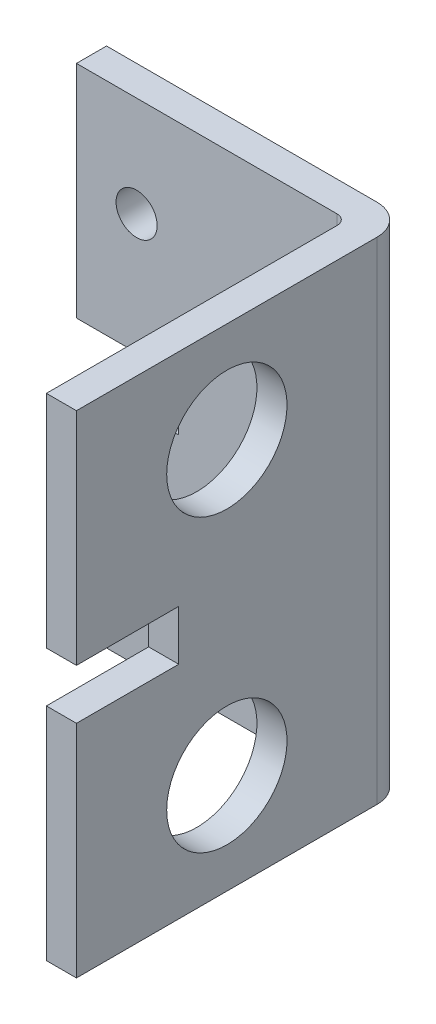
ISO-10303-21;
HEADER;
FILE_DESCRIPTION(('STEP AP214'),'2;1');
FILE_NAME('part.step','',(''),(''),'','','');
FILE_SCHEMA(('AUTOMOTIVE_DESIGN { 1 0 10303 214 1 1 1 1 }'));
ENDSEC;
DATA;
#1=APPLICATION_CONTEXT('core data for automotive mechanical design processes');
#2=APPLICATION_PROTOCOL_DEFINITION('international standard','automotive_design',2000,#1);
#3=PRODUCT_CONTEXT('',#1,'mechanical');
#4=PRODUCT('Part','Part','',(#3));
#5=PRODUCT_RELATED_PRODUCT_CATEGORY('part','',(#4));
#6=PRODUCT_DEFINITION_FORMATION('','',#4);
#7=PRODUCT_DEFINITION_CONTEXT('part definition',#1,'design');
#8=PRODUCT_DEFINITION('design','',#6,#7);
#9=PRODUCT_DEFINITION_SHAPE('','',#8);
#10=(LENGTH_UNIT() NAMED_UNIT(*) SI_UNIT(.MILLI.,.METRE.));
#11=(NAMED_UNIT(*) PLANE_ANGLE_UNIT() SI_UNIT($,.RADIAN.));
#12=(NAMED_UNIT(*) SI_UNIT($,.STERADIAN.) SOLID_ANGLE_UNIT());
#13=UNCERTAINTY_MEASURE_WITH_UNIT(LENGTH_MEASURE(1.E-05),#10,'distance_accuracy_value','');
#14=(GEOMETRIC_REPRESENTATION_CONTEXT(3) GLOBAL_UNCERTAINTY_ASSIGNED_CONTEXT((#13)) GLOBAL_UNIT_ASSIGNED_CONTEXT((#10,
#11,#12)) REPRESENTATION_CONTEXT('',''));
#15=CARTESIAN_POINT('',(0.,0.,0.));
#16=DIRECTION('',(0.,0.,1.));
#17=DIRECTION('',(1.,0.,0.));
#18=AXIS2_PLACEMENT_3D('',#15,#16,#17);
#19=CARTESIAN_POINT('',(30.,-33.1360830515618,33.));
#20=DIRECTION('',(0.,0.,1.));
#21=DIRECTION('',(1.,0.,0.));
#22=AXIS2_PLACEMENT_3D('',#19,#20,#21);
#23=PLANE('',#22);
#24=DIRECTION('',(-1.,0.,0.));
#25=VECTOR('',#24,1.);
#26=CARTESIAN_POINT('',(30.,22.,33.));
#27=LINE('',#26,#25);
#28=CARTESIAN_POINT('',(30.,22.,33.));
#29=VERTEX_POINT('',#28);
#30=CARTESIAN_POINT('',(27.,22.,33.));
#31=VERTEX_POINT('',#30);
#32=EDGE_CURVE('E171',#29,#31,#27,.T.);
#33=ORIENTED_EDGE('',*,*,#32,.T.);
#34=DIRECTION('',(0.,1.,0.));
#35=VECTOR('',#34,1.);
#36=CARTESIAN_POINT('',(27.,-33.1360830515618,33.));
#37=LINE('',#36,#35);
#38=CARTESIAN_POINT('',(27.,0.,33.));
#39=VERTEX_POINT('',#38);
#40=EDGE_CURVE('E237',#39,#31,#37,.T.);
#41=ORIENTED_EDGE('',*,*,#40,.F.);
#42=DIRECTION('',(-1.,0.,0.));
#43=VECTOR('',#42,1.);
#44=CARTESIAN_POINT('',(30.,0.,33.));
#45=LINE('',#44,#43);
#46=CARTESIAN_POINT('',(30.,0.,33.));
#47=VERTEX_POINT('',#46);
#48=EDGE_CURVE('E213',#47,#39,#45,.T.);
#49=ORIENTED_EDGE('',*,*,#48,.F.);
#50=DIRECTION('',(0.,1.,0.));
#51=VECTOR('',#50,1.);
#52=CARTESIAN_POINT('',(30.,-33.1360830515618,33.));
#53=LINE('',#52,#51);
#54=EDGE_CURVE('E234',#47,#29,#53,.T.);
#55=ORIENTED_EDGE('',*,*,#54,.T.);
#56=EDGE_LOOP('',(#33,#41,#49,#55));
#57=FACE_BOUND('',#56,.T.);
#58=ADVANCED_FACE('F33',(#57),#23,.T.);
#59=CARTESIAN_POINT('',(0.,0.,3.));
#60=DIRECTION('',(1.,0.,0.));
#61=DIRECTION('',(0.,0.,-1.));
#62=AXIS2_PLACEMENT_3D('',#59,#60,#61);
#63=PLANE('',#62);
#64=DIRECTION('',(0.,-1.,0.));
#65=VECTOR('',#64,1.);
#66=CARTESIAN_POINT('',(0.,0.,0.));
#67=LINE('',#66,#65);
#68=CARTESIAN_POINT('',(0.,49.,0.));
#69=VERTEX_POINT('',#68);
#70=CARTESIAN_POINT('',(0.,27.,0.));
#71=VERTEX_POINT('',#70);
#72=EDGE_CURVE('E277',#69,#71,#67,.T.);
#73=ORIENTED_EDGE('',*,*,#72,.T.);
#74=DIRECTION('',(0.,0.,1.));
#75=VECTOR('',#74,1.);
#76=CARTESIAN_POINT('',(0.,27.,3.));
#77=LINE('',#76,#75);
#78=CARTESIAN_POINT('',(0.,27.,3.));
#79=VERTEX_POINT('',#78);
#80=EDGE_CURVE('E11',#71,#79,#77,.T.);
#81=ORIENTED_EDGE('',*,*,#80,.T.);
#82=DIRECTION('',(0.,-1.,0.));
#83=VECTOR('',#82,1.);
#84=CARTESIAN_POINT('',(0.,0.,3.));
#85=LINE('',#84,#83);
#86=CARTESIAN_POINT('',(0.,49.,3.));
#87=VERTEX_POINT('',#86);
#88=EDGE_CURVE('E267',#87,#79,#85,.T.);
#89=ORIENTED_EDGE('',*,*,#88,.F.);
#90=DIRECTION('',(0.,0.,-1.));
#91=VECTOR('',#90,1.);
#92=CARTESIAN_POINT('',(0.,49.,3.));
#93=LINE('',#92,#91);
#94=EDGE_CURVE('E276',#87,#69,#93,.T.);
#95=ORIENTED_EDGE('',*,*,#94,.T.);
#96=EDGE_LOOP('',(#73,#81,#89,#95));
#97=FACE_BOUND('',#96,.T.);
#98=ADVANCED_FACE('F345',(#97),#63,.F.);
#99=CARTESIAN_POINT('',(0.,0.,3.));
#100=DIRECTION('',(0.,0.,-1.));
#101=DIRECTION('',(-1.,0.,0.));
#102=AXIS2_PLACEMENT_3D('',#99,#100,#101);
#103=PLANE('',#102);
#104=ORIENTED_EDGE('',*,*,#88,.T.);
#105=DIRECTION('',(-1.,0.,0.));
#106=VECTOR('',#105,1.);
#107=CARTESIAN_POINT('',(-3.,27.,3.));
#108=LINE('',#107,#106);
#109=CARTESIAN_POINT('',(10.2,27.,3.));
#110=VERTEX_POINT('',#109);
#111=EDGE_CURVE('E184',#110,#79,#108,.T.);
#112=ORIENTED_EDGE('',*,*,#111,.F.);
#113=DIRECTION('',(0.,1.,0.));
#114=VECTOR('',#113,1.);
#115=CARTESIAN_POINT('',(10.2,27.,3.));
#116=LINE('',#115,#114);
#117=CARTESIAN_POINT('',(10.2,22.,3.));
#118=VERTEX_POINT('',#117);
#119=EDGE_CURVE('E192',#118,#110,#116,.T.);
#120=ORIENTED_EDGE('',*,*,#119,.F.);
#121=DIRECTION('',(1.,0.,0.));
#122=VECTOR('',#121,1.);
#123=CARTESIAN_POINT('',(-3.,22.,3.));
#124=LINE('',#123,#122);
#125=CARTESIAN_POINT('',(0.,22.,3.));
#126=VERTEX_POINT('',#125);
#127=EDGE_CURVE('E181',#126,#118,#124,.T.);
#128=ORIENTED_EDGE('',*,*,#127,.F.);
#129=CARTESIAN_POINT('',(0.,0.,3.));
#130=VERTEX_POINT('',#129);
#131=EDGE_CURVE('E271',#126,#130,#85,.T.);
#132=ORIENTED_EDGE('',*,*,#131,.T.);
#133=DIRECTION('',(1.,0.,0.));
#134=VECTOR('',#133,1.);
#135=CARTESIAN_POINT('',(0.,0.,3.));
#136=LINE('',#135,#134);
#137=CARTESIAN_POINT('',(26.,0.,3.));
#138=VERTEX_POINT('',#137);
#139=EDGE_CURVE('E270',#130,#138,#136,.T.);
#140=ORIENTED_EDGE('',*,*,#139,.T.);
#141=DIRECTION('',(0.,1.,0.));
#142=VECTOR('',#141,1.);
#143=CARTESIAN_POINT('',(26.,0.,3.));
#144=LINE('',#143,#142);
#145=CARTESIAN_POINT('',(26.,49.,3.));
#146=VERTEX_POINT('',#145);
#147=EDGE_CURVE('E292',#138,#146,#144,.T.);
#148=ORIENTED_EDGE('',*,*,#147,.T.);
#149=DIRECTION('',(-1.,0.,0.));
#150=VECTOR('',#149,1.);
#151=CARTESIAN_POINT('',(0.,49.,3.));
#152=LINE('',#151,#150);
#153=EDGE_CURVE('E274',#146,#87,#152,.T.);
#154=ORIENTED_EDGE('',*,*,#153,.T.);
#155=EDGE_LOOP('',(#104,#112,#120,#128,#132,#140,#148,#154));
#156=FACE_BOUND('',#155,.T.);
#157=CARTESIAN_POINT('',(6.00000000000001,39.,3.));
#158=DIRECTION('',(0.,0.,1.));
#159=DIRECTION('',(1.,0.,0.));
#160=AXIS2_PLACEMENT_3D('',#157,#158,#159);
#161=CIRCLE('',#160,2.05000000000001);
#162=CARTESIAN_POINT('',(8.05000000000001,39.,3.));
#163=VERTEX_POINT('',#162);
#164=EDGE_CURVE('E261',#163,#163,#161,.T.);
#165=ORIENTED_EDGE('',*,*,#164,.F.);
#166=EDGE_LOOP('',(#165));
#167=FACE_BOUND('',#166,.T.);
#168=CARTESIAN_POINT('',(21.,39.,3.));
#169=DIRECTION('',(0.,0.,1.));
#170=DIRECTION('',(1.,0.,0.));
#171=AXIS2_PLACEMENT_3D('',#168,#169,#170);
#172=CIRCLE('',#171,2.05);
#173=CARTESIAN_POINT('',(23.05,39.,3.));
#174=VERTEX_POINT('',#173);
#175=EDGE_CURVE('E255',#174,#174,#172,.T.);
#176=ORIENTED_EDGE('',*,*,#175,.F.);
#177=EDGE_LOOP('',(#176));
#178=FACE_BOUND('',#177,.T.);
#179=CARTESIAN_POINT('',(6.,10.,3.));
#180=DIRECTION('',(0.,0.,1.));
#181=DIRECTION('',(1.,0.,0.));
#182=AXIS2_PLACEMENT_3D('',#179,#180,#181);
#183=CIRCLE('',#182,2.05);
#184=CARTESIAN_POINT('',(8.05,10.,3.));
#185=VERTEX_POINT('',#184);
#186=EDGE_CURVE('E249',#185,#185,#183,.T.);
#187=ORIENTED_EDGE('',*,*,#186,.F.);
#188=EDGE_LOOP('',(#187));
#189=FACE_BOUND('',#188,.T.);
#190=CARTESIAN_POINT('',(21.,10.,3.));
#191=DIRECTION('',(0.,0.,1.));
#192=DIRECTION('',(1.,0.,0.));
#193=AXIS2_PLACEMENT_3D('',#190,#191,#192);
#194=CIRCLE('',#193,2.05);
#195=CARTESIAN_POINT('',(23.05,10.,3.));
#196=VERTEX_POINT('',#195);
#197=EDGE_CURVE('E243',#196,#196,#194,.T.);
#198=ORIENTED_EDGE('',*,*,#197,.F.);
#199=EDGE_LOOP('',(#198));
#200=FACE_BOUND('',#199,.T.);
#201=ADVANCED_FACE('F318',(#156,#167,#178,#189,#200),#103,.F.);
#202=CARTESIAN_POINT('',(0.,0.,0.));
#203=DIRECTION('',(0.,0.,-1.));
#204=DIRECTION('',(-1.,0.,0.));
#205=AXIS2_PLACEMENT_3D('',#202,#203,#204);
#206=PLANE('',#205);
#207=DIRECTION('',(-1.,0.,0.));
#208=VECTOR('',#207,1.);
#209=CARTESIAN_POINT('',(-3.,27.,0.));
#210=LINE('',#209,#208);
#211=CARTESIAN_POINT('',(10.2,27.,0.));
#212=VERTEX_POINT('',#211);
#213=EDGE_CURVE('E187',#212,#71,#210,.T.);
#214=ORIENTED_EDGE('',*,*,#213,.T.);
#215=ORIENTED_EDGE('',*,*,#72,.F.);
#216=DIRECTION('',(-1.,0.,0.));
#217=VECTOR('',#216,1.);
#218=CARTESIAN_POINT('',(0.,49.,0.));
#219=LINE('',#218,#217);
#220=CARTESIAN_POINT('',(27.,49.,0.));
#221=VERTEX_POINT('',#220);
#222=EDGE_CURVE('E285',#221,#69,#219,.T.);
#223=ORIENTED_EDGE('',*,*,#222,.F.);
#224=DIRECTION('',(0.,1.,0.));
#225=VECTOR('',#224,1.);
#226=CARTESIAN_POINT('',(27.,0.,0.));
#227=LINE('',#226,#225);
#228=CARTESIAN_POINT('',(27.,0.,0.));
#229=VERTEX_POINT('',#228);
#230=EDGE_CURVE('E283',#229,#221,#227,.T.);
#231=ORIENTED_EDGE('',*,*,#230,.F.);
#232=DIRECTION('',(1.,0.,0.));
#233=VECTOR('',#232,1.);
#234=CARTESIAN_POINT('',(0.,0.,0.));
#235=LINE('',#234,#233);
#236=CARTESIAN_POINT('',(0.,0.,0.));
#237=VERTEX_POINT('',#236);
#238=EDGE_CURVE('E280',#237,#229,#235,.T.);
#239=ORIENTED_EDGE('',*,*,#238,.F.);
#240=CARTESIAN_POINT('',(0.,22.,0.));
#241=VERTEX_POINT('',#240);
#242=EDGE_CURVE('E264',#241,#237,#67,.T.);
#243=ORIENTED_EDGE('',*,*,#242,.F.);
#244=DIRECTION('',(1.,0.,0.));
#245=VECTOR('',#244,1.);
#246=CARTESIAN_POINT('',(-3.,22.,0.));
#247=LINE('',#246,#245);
#248=CARTESIAN_POINT('',(10.2,22.,0.));
#249=VERTEX_POINT('',#248);
#250=EDGE_CURVE('E56',#241,#249,#247,.T.);
#251=ORIENTED_EDGE('',*,*,#250,.T.);
#252=DIRECTION('',(0.,1.,0.));
#253=VECTOR('',#252,1.);
#254=CARTESIAN_POINT('',(10.2,27.,0.));
#255=LINE('',#254,#253);
#256=EDGE_CURVE('E183',#249,#212,#255,.T.);
#257=ORIENTED_EDGE('',*,*,#256,.T.);
#258=EDGE_LOOP('',(#214,#215,#223,#231,#239,#243,#251,#257));
#259=FACE_BOUND('',#258,.T.);
#260=CARTESIAN_POINT('',(6.,10.,0.));
#261=DIRECTION('',(0.,0.,1.));
#262=DIRECTION('',(1.,0.,0.));
#263=AXIS2_PLACEMENT_3D('',#260,#261,#262);
#264=CIRCLE('',#263,2.05);
#265=CARTESIAN_POINT('',(8.05,10.,0.));
#266=VERTEX_POINT('',#265);
#267=EDGE_CURVE('E246',#266,#266,#264,.T.);
#268=ORIENTED_EDGE('',*,*,#267,.T.);
#269=EDGE_LOOP('',(#268));
#270=FACE_BOUND('',#269,.T.);
#271=CARTESIAN_POINT('',(6.00000000000001,39.,0.));
#272=DIRECTION('',(0.,0.,1.));
#273=DIRECTION('',(1.,0.,0.));
#274=AXIS2_PLACEMENT_3D('',#271,#272,#273);
#275=CIRCLE('',#274,2.05000000000001);
#276=CARTESIAN_POINT('',(8.05000000000001,39.,0.));
#277=VERTEX_POINT('',#276);
#278=EDGE_CURVE('E258',#277,#277,#275,.T.);
#279=ORIENTED_EDGE('',*,*,#278,.T.);
#280=EDGE_LOOP('',(#279));
#281=FACE_BOUND('',#280,.T.);
#282=CARTESIAN_POINT('',(21.,39.,0.));
#283=DIRECTION('',(0.,0.,1.));
#284=DIRECTION('',(1.,0.,0.));
#285=AXIS2_PLACEMENT_3D('',#282,#283,#284);
#286=CIRCLE('',#285,2.05);
#287=CARTESIAN_POINT('',(23.05,39.,0.));
#288=VERTEX_POINT('',#287);
#289=EDGE_CURVE('E252',#288,#288,#286,.T.);
#290=ORIENTED_EDGE('',*,*,#289,.T.);
#291=EDGE_LOOP('',(#290));
#292=FACE_BOUND('',#291,.T.);
#293=CARTESIAN_POINT('',(21.,10.,0.));
#294=DIRECTION('',(0.,0.,1.));
#295=DIRECTION('',(1.,0.,0.));
#296=AXIS2_PLACEMENT_3D('',#293,#294,#295);
#297=CIRCLE('',#296,2.05);
#298=CARTESIAN_POINT('',(23.05,10.,0.));
#299=VERTEX_POINT('',#298);
#300=EDGE_CURVE('E242',#299,#299,#297,.T.);
#301=ORIENTED_EDGE('',*,*,#300,.T.);
#302=EDGE_LOOP('',(#301));
#303=FACE_BOUND('',#302,.T.);
#304=ADVANCED_FACE('F308',(#259,#270,#281,#292,#303),#206,.T.);
#305=ORIENTED_EDGE('',*,*,#131,.F.);
#306=DIRECTION('',(0.,0.,-1.));
#307=VECTOR('',#306,1.);
#308=CARTESIAN_POINT('',(0.,22.,3.));
#309=LINE('',#308,#307);
#310=EDGE_CURVE('E41',#126,#241,#309,.T.);
#311=ORIENTED_EDGE('',*,*,#310,.T.);
#312=ORIENTED_EDGE('',*,*,#242,.T.);
#313=DIRECTION('',(0.,0.,-1.));
#314=VECTOR('',#313,1.);
#315=CARTESIAN_POINT('',(0.,0.,3.));
#316=LINE('',#315,#314);
#317=EDGE_CURVE('E289',#130,#237,#316,.T.);
#318=ORIENTED_EDGE('',*,*,#317,.F.);
#319=EDGE_LOOP('',(#305,#311,#312,#318));
#320=FACE_BOUND('',#319,.T.);
#321=ADVANCED_FACE('F303',(#320),#63,.F.);
#322=CARTESIAN_POINT('',(0.,0.,3.));
#323=DIRECTION('',(0.,1.,0.));
#324=DIRECTION('',(0.,0.,1.));
#325=AXIS2_PLACEMENT_3D('',#322,#323,#324);
#326=PLANE('',#325);
#327=ORIENTED_EDGE('',*,*,#238,.T.);
#328=CARTESIAN_POINT('',(27.,0.,3.));
#329=DIRECTION('',(0.,1.,0.));
#330=DIRECTION('',(0.,0.,1.));
#331=AXIS2_PLACEMENT_3D('',#328,#329,#330);
#332=CIRCLE('',#331,3.);
#333=CARTESIAN_POINT('',(30.,0.,3.));
#334=VERTEX_POINT('',#333);
#335=EDGE_CURVE('E218',#229,#334,#332,.F.);
#336=ORIENTED_EDGE('',*,*,#335,.T.);
#337=DIRECTION('',(0.,0.,1.));
#338=VECTOR('',#337,1.);
#339=CARTESIAN_POINT('',(30.,0.,3.));
#340=LINE('',#339,#338);
#341=EDGE_CURVE('E215',#334,#47,#340,.T.);
#342=ORIENTED_EDGE('',*,*,#341,.T.);
#343=ORIENTED_EDGE('',*,*,#48,.T.);
#344=DIRECTION('',(0.,0.,-1.));
#345=VECTOR('',#344,1.);
#346=CARTESIAN_POINT('',(27.,0.,33.));
#347=LINE('',#346,#345);
#348=CARTESIAN_POINT('',(27.,0.,4.));
#349=VERTEX_POINT('',#348);
#350=EDGE_CURVE('E220',#39,#349,#347,.T.);
#351=ORIENTED_EDGE('',*,*,#350,.T.);
#352=CARTESIAN_POINT('',(26.,0.,4.));
#353=DIRECTION('',(0.,1.,0.));
#354=DIRECTION('',(0.,0.,1.));
#355=AXIS2_PLACEMENT_3D('',#352,#353,#354);
#356=CIRCLE('',#355,1.);
#357=EDGE_CURVE('E299',#349,#138,#356,.T.);
#358=ORIENTED_EDGE('',*,*,#357,.T.);
#359=ORIENTED_EDGE('',*,*,#139,.F.);
#360=ORIENTED_EDGE('',*,*,#317,.T.);
#361=EDGE_LOOP('',(#327,#336,#342,#343,#351,#358,#359,#360));
#362=FACE_BOUND('',#361,.T.);
#363=ADVANCED_FACE('F314',(#362),#326,.F.);
#364=CARTESIAN_POINT('',(0.,49.,3.));
#365=DIRECTION('',(0.,-1.,0.));
#366=DIRECTION('',(0.,0.,-1.));
#367=AXIS2_PLACEMENT_3D('',#364,#365,#366);
#368=PLANE('',#367);
#369=ORIENTED_EDGE('',*,*,#222,.T.);
#370=ORIENTED_EDGE('',*,*,#94,.F.);
#371=ORIENTED_EDGE('',*,*,#153,.F.);
#372=CARTESIAN_POINT('',(26.,49.,4.));
#373=DIRECTION('',(0.,-1.,0.));
#374=DIRECTION('',(0.,0.,-1.));
#375=AXIS2_PLACEMENT_3D('',#372,#373,#374);
#376=CIRCLE('',#375,1.);
#377=CARTESIAN_POINT('',(27.,49.,4.));
#378=VERTEX_POINT('',#377);
#379=EDGE_CURVE('E297',#146,#378,#376,.T.);
#380=ORIENTED_EDGE('',*,*,#379,.T.);
#381=DIRECTION('',(0.,0.,1.));
#382=VECTOR('',#381,1.);
#383=CARTESIAN_POINT('',(27.,49.,33.));
#384=LINE('',#383,#382);
#385=CARTESIAN_POINT('',(27.,49.,33.));
#386=VERTEX_POINT('',#385);
#387=EDGE_CURVE('E223',#378,#386,#384,.T.);
#388=ORIENTED_EDGE('',*,*,#387,.T.);
#389=DIRECTION('',(1.,0.,0.));
#390=VECTOR('',#389,1.);
#391=CARTESIAN_POINT('',(30.,49.,33.));
#392=LINE('',#391,#390);
#393=CARTESIAN_POINT('',(30.,49.,33.));
#394=VERTEX_POINT('',#393);
#395=EDGE_CURVE('E226',#386,#394,#392,.T.);
#396=ORIENTED_EDGE('',*,*,#395,.T.);
#397=DIRECTION('',(0.,0.,-1.));
#398=VECTOR('',#397,1.);
#399=CARTESIAN_POINT('',(30.,49.,3.));
#400=LINE('',#399,#398);
#401=CARTESIAN_POINT('',(30.,49.,3.));
#402=VERTEX_POINT('',#401);
#403=EDGE_CURVE('E229',#394,#402,#400,.T.);
#404=ORIENTED_EDGE('',*,*,#403,.T.);
#405=CARTESIAN_POINT('',(27.,49.,3.));
#406=DIRECTION('',(0.,1.,0.));
#407=DIRECTION('',(0.,0.,-1.));
#408=AXIS2_PLACEMENT_3D('',#405,#406,#407);
#409=CIRCLE('',#408,3.);
#410=EDGE_CURVE('E204',#402,#221,#409,.T.);
#411=ORIENTED_EDGE('',*,*,#410,.T.);
#412=EDGE_LOOP('',(#369,#370,#371,#380,#388,#396,#404,#411));
#413=FACE_BOUND('',#412,.T.);
#414=ADVANCED_FACE('F325',(#413),#368,.F.);
#415=CARTESIAN_POINT('',(6.00000000000001,39.,3.));
#416=DIRECTION('',(0.,0.,-1.));
#417=DIRECTION('',(-1.,0.,0.));
#418=AXIS2_PLACEMENT_3D('',#415,#416,#417);
#419=CYLINDRICAL_SURFACE('',#418,2.05000000000001);
#420=ORIENTED_EDGE('',*,*,#164,.T.);
#421=EDGE_LOOP('',(#420));
#422=FACE_BOUND('',#421,.T.);
#423=ORIENTED_EDGE('',*,*,#278,.F.);
#424=EDGE_LOOP('',(#423));
#425=FACE_BOUND('',#424,.T.);
#426=ADVANCED_FACE('F412',(#422,#425),#419,.F.);
#427=CARTESIAN_POINT('',(21.,39.,3.));
#428=DIRECTION('',(0.,0.,-1.));
#429=DIRECTION('',(-1.,0.,0.));
#430=AXIS2_PLACEMENT_3D('',#427,#428,#429);
#431=CYLINDRICAL_SURFACE('',#430,2.05);
#432=ORIENTED_EDGE('',*,*,#175,.T.);
#433=EDGE_LOOP('',(#432));
#434=FACE_BOUND('',#433,.T.);
#435=ORIENTED_EDGE('',*,*,#289,.F.);
#436=EDGE_LOOP('',(#435));
#437=FACE_BOUND('',#436,.T.);
#438=ADVANCED_FACE('F408',(#434,#437),#431,.F.);
#439=CARTESIAN_POINT('',(6.,10.,3.));
#440=DIRECTION('',(0.,0.,-1.));
#441=DIRECTION('',(-1.,0.,0.));
#442=AXIS2_PLACEMENT_3D('',#439,#440,#441);
#443=CYLINDRICAL_SURFACE('',#442,2.05);
#444=ORIENTED_EDGE('',*,*,#186,.T.);
#445=EDGE_LOOP('',(#444));
#446=FACE_BOUND('',#445,.T.);
#447=ORIENTED_EDGE('',*,*,#267,.F.);
#448=EDGE_LOOP('',(#447));
#449=FACE_BOUND('',#448,.T.);
#450=ADVANCED_FACE('F402',(#446,#449),#443,.F.);
#451=CARTESIAN_POINT('',(21.,10.,3.));
#452=DIRECTION('',(0.,0.,-1.));
#453=DIRECTION('',(-1.,0.,0.));
#454=AXIS2_PLACEMENT_3D('',#451,#452,#453);
#455=CYLINDRICAL_SURFACE('',#454,2.05);
#456=ORIENTED_EDGE('',*,*,#197,.T.);
#457=EDGE_LOOP('',(#456));
#458=FACE_BOUND('',#457,.T.);
#459=ORIENTED_EDGE('',*,*,#300,.F.);
#460=EDGE_LOOP('',(#459));
#461=FACE_BOUND('',#460,.T.);
#462=ADVANCED_FACE('F396',(#458,#461),#455,.F.);
#463=CARTESIAN_POINT('',(27.,-33.1360830515618,33.));
#464=DIRECTION('',(-1.,0.,0.));
#465=DIRECTION('',(0.,0.,1.));
#466=AXIS2_PLACEMENT_3D('',#463,#464,#465);
#467=PLANE('',#466);
#468=DIRECTION('',(0.,0.,1.));
#469=VECTOR('',#468,1.);
#470=CARTESIAN_POINT('',(27.,22.,33.));
#471=LINE('',#470,#469);
#472=CARTESIAN_POINT('',(27.,22.,22.8));
#473=VERTEX_POINT('',#472);
#474=EDGE_CURVE('E177',#473,#31,#471,.T.);
#475=ORIENTED_EDGE('',*,*,#474,.F.);
#476=DIRECTION('',(0.,-1.,0.));
#477=VECTOR('',#476,1.);
#478=CARTESIAN_POINT('',(27.,-33.1360830515618,22.8));
#479=LINE('',#478,#477);
#480=CARTESIAN_POINT('',(27.,27.,22.8));
#481=VERTEX_POINT('',#480);
#482=EDGE_CURVE('E179',#481,#473,#479,.T.);
#483=ORIENTED_EDGE('',*,*,#482,.F.);
#484=DIRECTION('',(0.,0.,-1.));
#485=VECTOR('',#484,1.);
#486=CARTESIAN_POINT('',(27.,27.,33.));
#487=LINE('',#486,#485);
#488=CARTESIAN_POINT('',(27.,27.,33.));
#489=VERTEX_POINT('',#488);
#490=EDGE_CURVE('E148',#489,#481,#487,.T.);
#491=ORIENTED_EDGE('',*,*,#490,.F.);
#492=EDGE_CURVE('E232',#489,#386,#37,.T.);
#493=ORIENTED_EDGE('',*,*,#492,.T.);
#494=ORIENTED_EDGE('',*,*,#387,.F.);
#495=DIRECTION('',(0.,1.,0.));
#496=VECTOR('',#495,1.);
#497=CARTESIAN_POINT('',(27.,-33.1360830515618,4.));
#498=LINE('',#497,#496);
#499=EDGE_CURVE('E295',#378,#349,#498,.F.);
#500=ORIENTED_EDGE('',*,*,#499,.T.);
#501=ORIENTED_EDGE('',*,*,#350,.F.);
#502=ORIENTED_EDGE('',*,*,#40,.T.);
#503=EDGE_LOOP('',(#475,#483,#491,#493,#494,#500,#501,#502));
#504=FACE_BOUND('',#503,.T.);
#505=CARTESIAN_POINT('',(27.,39.,18.));
#506=DIRECTION('',(-1.,0.,0.));
#507=DIRECTION('',(0.,0.,1.));
#508=AXIS2_PLACEMENT_3D('',#505,#506,#507);
#509=CIRCLE('',#508,6.);
#510=CARTESIAN_POINT('',(27.,39.,24.));
#511=VERTEX_POINT('',#510);
#512=EDGE_CURVE('E205',#511,#511,#509,.T.);
#513=ORIENTED_EDGE('',*,*,#512,.F.);
#514=EDGE_LOOP('',(#513));
#515=FACE_BOUND('',#514,.T.);
#516=CARTESIAN_POINT('',(27.,9.99999999999999,18.));
#517=DIRECTION('',(-1.,0.,0.));
#518=DIRECTION('',(0.,0.,1.));
#519=AXIS2_PLACEMENT_3D('',#516,#517,#518);
#520=CIRCLE('',#519,6.);
#521=CARTESIAN_POINT('',(27.,9.99999999999999,24.));
#522=VERTEX_POINT('',#521);
#523=EDGE_CURVE('E198',#522,#522,#520,.T.);
#524=ORIENTED_EDGE('',*,*,#523,.F.);
#525=EDGE_LOOP('',(#524));
#526=FACE_BOUND('',#525,.T.);
#527=ADVANCED_FACE('F330',(#504,#515,#526),#467,.T.);
#528=CARTESIAN_POINT('',(27.,-33.1360830515618,3.));
#529=DIRECTION('',(0.,1.,0.));
#530=DIRECTION('',(0.,0.,1.));
#531=AXIS2_PLACEMENT_3D('',#528,#529,#530);
#532=CYLINDRICAL_SURFACE('',#531,3.);
#533=ORIENTED_EDGE('',*,*,#335,.F.);
#534=ORIENTED_EDGE('',*,*,#230,.T.);
#535=ORIENTED_EDGE('',*,*,#410,.F.);
#536=DIRECTION('',(0.,1.,0.));
#537=VECTOR('',#536,1.);
#538=CARTESIAN_POINT('',(30.,-33.1360830515618,3.));
#539=LINE('',#538,#537);
#540=EDGE_CURVE('E216',#334,#402,#539,.T.);
#541=ORIENTED_EDGE('',*,*,#540,.F.);
#542=EDGE_LOOP('',(#533,#534,#535,#541));
#543=FACE_BOUND('',#542,.T.);
#544=ADVANCED_FACE('F341',(#543),#532,.T.);
#545=CARTESIAN_POINT('',(30.,-33.1360830515618,3.));
#546=DIRECTION('',(1.,0.,0.));
#547=DIRECTION('',(0.,0.,-1.));
#548=AXIS2_PLACEMENT_3D('',#545,#546,#547);
#549=PLANE('',#548);
#550=DIRECTION('',(0.,0.,1.));
#551=VECTOR('',#550,1.);
#552=CARTESIAN_POINT('',(30.,22.,33.));
#553=LINE('',#552,#551);
#554=CARTESIAN_POINT('',(30.,22.,22.8));
#555=VERTEX_POINT('',#554);
#556=EDGE_CURVE('E161',#555,#29,#553,.T.);
#557=ORIENTED_EDGE('',*,*,#556,.T.);
#558=ORIENTED_EDGE('',*,*,#54,.F.);
#559=ORIENTED_EDGE('',*,*,#341,.F.);
#560=ORIENTED_EDGE('',*,*,#540,.T.);
#561=ORIENTED_EDGE('',*,*,#403,.F.);
#562=CARTESIAN_POINT('',(30.,27.,33.));
#563=VERTEX_POINT('',#562);
#564=EDGE_CURVE('E167',#563,#394,#53,.T.);
#565=ORIENTED_EDGE('',*,*,#564,.F.);
#566=DIRECTION('',(0.,0.,-1.));
#567=VECTOR('',#566,1.);
#568=CARTESIAN_POINT('',(30.,27.,33.));
#569=LINE('',#568,#567);
#570=CARTESIAN_POINT('',(30.,27.,22.8));
#571=VERTEX_POINT('',#570);
#572=EDGE_CURVE('E48',#563,#571,#569,.T.);
#573=ORIENTED_EDGE('',*,*,#572,.T.);
#574=DIRECTION('',(0.,-1.,0.));
#575=VECTOR('',#574,1.);
#576=CARTESIAN_POINT('',(30.,27.,22.8));
#577=LINE('',#576,#575);
#578=EDGE_CURVE('E155',#571,#555,#577,.T.);
#579=ORIENTED_EDGE('',*,*,#578,.T.);
#580=EDGE_LOOP('',(#557,#558,#559,#560,#561,#565,#573,#579));
#581=FACE_BOUND('',#580,.T.);
#582=CARTESIAN_POINT('',(30.,39.,18.));
#583=DIRECTION('',(-1.,0.,0.));
#584=DIRECTION('',(0.,0.,1.));
#585=AXIS2_PLACEMENT_3D('',#582,#583,#584);
#586=CIRCLE('',#585,6.);
#587=CARTESIAN_POINT('',(30.,39.,24.));
#588=VERTEX_POINT('',#587);
#589=EDGE_CURVE('E201',#588,#588,#586,.T.);
#590=ORIENTED_EDGE('',*,*,#589,.T.);
#591=EDGE_LOOP('',(#590));
#592=FACE_BOUND('',#591,.T.);
#593=CARTESIAN_POINT('',(30.,9.99999999999999,18.));
#594=DIRECTION('',(-1.,0.,0.));
#595=DIRECTION('',(0.,0.,1.));
#596=AXIS2_PLACEMENT_3D('',#593,#594,#595);
#597=CIRCLE('',#596,6.);
#598=CARTESIAN_POINT('',(30.,9.99999999999999,24.));
#599=VERTEX_POINT('',#598);
#600=EDGE_CURVE('E208',#599,#599,#597,.T.);
#601=ORIENTED_EDGE('',*,*,#600,.T.);
#602=EDGE_LOOP('',(#601));
#603=FACE_BOUND('',#602,.T.);
#604=ADVANCED_FACE('F164',(#581,#592,#603),#549,.T.);
#605=DIRECTION('',(-1.,0.,0.));
#606=VECTOR('',#605,1.);
#607=CARTESIAN_POINT('',(30.,27.,33.));
#608=LINE('',#607,#606);
#609=EDGE_CURVE('E152',#563,#489,#608,.T.);
#610=ORIENTED_EDGE('',*,*,#609,.F.);
#611=ORIENTED_EDGE('',*,*,#564,.T.);
#612=ORIENTED_EDGE('',*,*,#395,.F.);
#613=ORIENTED_EDGE('',*,*,#492,.F.);
#614=EDGE_LOOP('',(#610,#611,#612,#613));
#615=FACE_BOUND('',#614,.T.);
#616=ADVANCED_FACE('F335',(#615),#23,.T.);
#617=CARTESIAN_POINT('',(30.,9.99999999999999,18.));
#618=DIRECTION('',(-1.,0.,0.));
#619=DIRECTION('',(0.,0.,1.));
#620=AXIS2_PLACEMENT_3D('',#617,#618,#619);
#621=CYLINDRICAL_SURFACE('',#620,6.);
#622=ORIENTED_EDGE('',*,*,#600,.F.);
#623=EDGE_LOOP('',(#622));
#624=FACE_BOUND('',#623,.T.);
#625=ORIENTED_EDGE('',*,*,#523,.T.);
#626=EDGE_LOOP('',(#625));
#627=FACE_BOUND('',#626,.T.);
#628=ADVANCED_FACE('F374',(#624,#627),#621,.F.);
#629=CARTESIAN_POINT('',(30.,39.,18.));
#630=DIRECTION('',(-1.,0.,0.));
#631=DIRECTION('',(0.,0.,1.));
#632=AXIS2_PLACEMENT_3D('',#629,#630,#631);
#633=CYLINDRICAL_SURFACE('',#632,6.);
#634=ORIENTED_EDGE('',*,*,#589,.F.);
#635=EDGE_LOOP('',(#634));
#636=FACE_BOUND('',#635,.T.);
#637=ORIENTED_EDGE('',*,*,#512,.T.);
#638=EDGE_LOOP('',(#637));
#639=FACE_BOUND('',#638,.T.);
#640=ADVANCED_FACE('F379',(#636,#639),#633,.F.);
#641=CARTESIAN_POINT('',(26.,0.,4.));
#642=DIRECTION('',(0.,1.,0.));
#643=DIRECTION('',(0.,0.,1.));
#644=AXIS2_PLACEMENT_3D('',#641,#642,#643);
#645=CYLINDRICAL_SURFACE('',#644,1.);
#646=ORIENTED_EDGE('',*,*,#357,.F.);
#647=ORIENTED_EDGE('',*,*,#499,.F.);
#648=ORIENTED_EDGE('',*,*,#379,.F.);
#649=ORIENTED_EDGE('',*,*,#147,.F.);
#650=EDGE_LOOP('',(#646,#647,#648,#649));
#651=FACE_BOUND('',#650,.T.);
#652=ADVANCED_FACE('F35',(#651),#645,.F.);
#653=CARTESIAN_POINT('',(-3.,27.,0.));
#654=DIRECTION('',(0.,1.,0.));
#655=DIRECTION('',(0.,0.,1.));
#656=AXIS2_PLACEMENT_3D('',#653,#654,#655);
#657=PLANE('',#656);
#658=ORIENTED_EDGE('',*,*,#213,.F.);
#659=DIRECTION('',(0.,0.,1.));
#660=VECTOR('',#659,1.);
#661=CARTESIAN_POINT('',(10.2,27.,0.));
#662=LINE('',#661,#660);
#663=EDGE_CURVE('E196',#212,#110,#662,.T.);
#664=ORIENTED_EDGE('',*,*,#663,.T.);
#665=ORIENTED_EDGE('',*,*,#111,.T.);
#666=ORIENTED_EDGE('',*,*,#80,.F.);
#667=EDGE_LOOP('',(#658,#664,#665,#666));
#668=FACE_BOUND('',#667,.T.);
#669=ADVANCED_FACE('F350',(#668),#657,.F.);
#670=CARTESIAN_POINT('',(-3.,22.,0.));
#671=DIRECTION('',(0.,-1.,0.));
#672=DIRECTION('',(0.,0.,-1.));
#673=AXIS2_PLACEMENT_3D('',#670,#671,#672);
#674=PLANE('',#673);
#675=ORIENTED_EDGE('',*,*,#127,.T.);
#676=DIRECTION('',(0.,0.,1.));
#677=VECTOR('',#676,1.);
#678=CARTESIAN_POINT('',(10.2,22.,0.));
#679=LINE('',#678,#677);
#680=EDGE_CURVE('E190',#249,#118,#679,.T.);
#681=ORIENTED_EDGE('',*,*,#680,.F.);
#682=ORIENTED_EDGE('',*,*,#250,.F.);
#683=ORIENTED_EDGE('',*,*,#310,.F.);
#684=EDGE_LOOP('',(#675,#681,#682,#683));
#685=FACE_BOUND('',#684,.T.);
#686=ADVANCED_FACE('F354',(#685),#674,.F.);
#687=CARTESIAN_POINT('',(10.2,27.,0.));
#688=DIRECTION('',(1.,0.,0.));
#689=DIRECTION('',(0.,0.,-1.));
#690=AXIS2_PLACEMENT_3D('',#687,#688,#689);
#691=PLANE('',#690);
#692=ORIENTED_EDGE('',*,*,#119,.T.);
#693=ORIENTED_EDGE('',*,*,#663,.F.);
#694=ORIENTED_EDGE('',*,*,#256,.F.);
#695=ORIENTED_EDGE('',*,*,#680,.T.);
#696=EDGE_LOOP('',(#692,#693,#694,#695));
#697=FACE_BOUND('',#696,.T.);
#698=ADVANCED_FACE('F353',(#697),#691,.F.);
#699=CARTESIAN_POINT('',(30.,22.,33.));
#700=DIRECTION('',(0.,-1.,0.));
#701=DIRECTION('',(0.,0.,-1.));
#702=AXIS2_PLACEMENT_3D('',#699,#700,#701);
#703=PLANE('',#702);
#704=ORIENTED_EDGE('',*,*,#474,.T.);
#705=ORIENTED_EDGE('',*,*,#32,.F.);
#706=ORIENTED_EDGE('',*,*,#556,.F.);
#707=DIRECTION('',(-1.,0.,0.));
#708=VECTOR('',#707,1.);
#709=CARTESIAN_POINT('',(30.,22.,22.8));
#710=LINE('',#709,#708);
#711=EDGE_CURVE('E151',#555,#473,#710,.T.);
#712=ORIENTED_EDGE('',*,*,#711,.T.);
#713=EDGE_LOOP('',(#704,#705,#706,#712));
#714=FACE_BOUND('',#713,.T.);
#715=ADVANCED_FACE('F361',(#714),#703,.F.);
#716=CARTESIAN_POINT('',(30.,27.,22.8));
#717=DIRECTION('',(0.,0.,-1.));
#718=DIRECTION('',(-1.,0.,0.));
#719=AXIS2_PLACEMENT_3D('',#716,#717,#718);
#720=PLANE('',#719);
#721=ORIENTED_EDGE('',*,*,#482,.T.);
#722=ORIENTED_EDGE('',*,*,#711,.F.);
#723=ORIENTED_EDGE('',*,*,#578,.F.);
#724=DIRECTION('',(-1.,0.,0.));
#725=VECTOR('',#724,1.);
#726=CARTESIAN_POINT('',(30.,27.,22.8));
#727=LINE('',#726,#725);
#728=EDGE_CURVE('E144',#571,#481,#727,.T.);
#729=ORIENTED_EDGE('',*,*,#728,.T.);
#730=EDGE_LOOP('',(#721,#722,#723,#729));
#731=FACE_BOUND('',#730,.T.);
#732=ADVANCED_FACE('F156',(#731),#720,.F.);
#733=CARTESIAN_POINT('',(30.,27.,33.));
#734=DIRECTION('',(0.,1.,0.));
#735=DIRECTION('',(0.,0.,1.));
#736=AXIS2_PLACEMENT_3D('',#733,#734,#735);
#737=PLANE('',#736);
#738=ORIENTED_EDGE('',*,*,#490,.T.);
#739=ORIENTED_EDGE('',*,*,#728,.F.);
#740=ORIENTED_EDGE('',*,*,#572,.F.);
#741=ORIENTED_EDGE('',*,*,#609,.T.);
#742=EDGE_LOOP('',(#738,#739,#740,#741));
#743=FACE_BOUND('',#742,.T.);
#744=ADVANCED_FACE('F146',(#743),#737,.F.);
#745=CLOSED_SHELL('',(#58,#98,#201,#304,#321,#363,#414,#426,#438,#450,#462,#527,#544,#604,#616,
#628,#640,#652,#669,#686,#698,#715,#732,#744));
#746=MANIFOLD_SOLID_BREP('B2',#745);
#747=ADVANCED_BREP_SHAPE_REPRESENTATION('',(#18,#746),#14);
#748=SHAPE_DEFINITION_REPRESENTATION(#9,#747);
ENDSEC;
END-ISO-10303-21;
